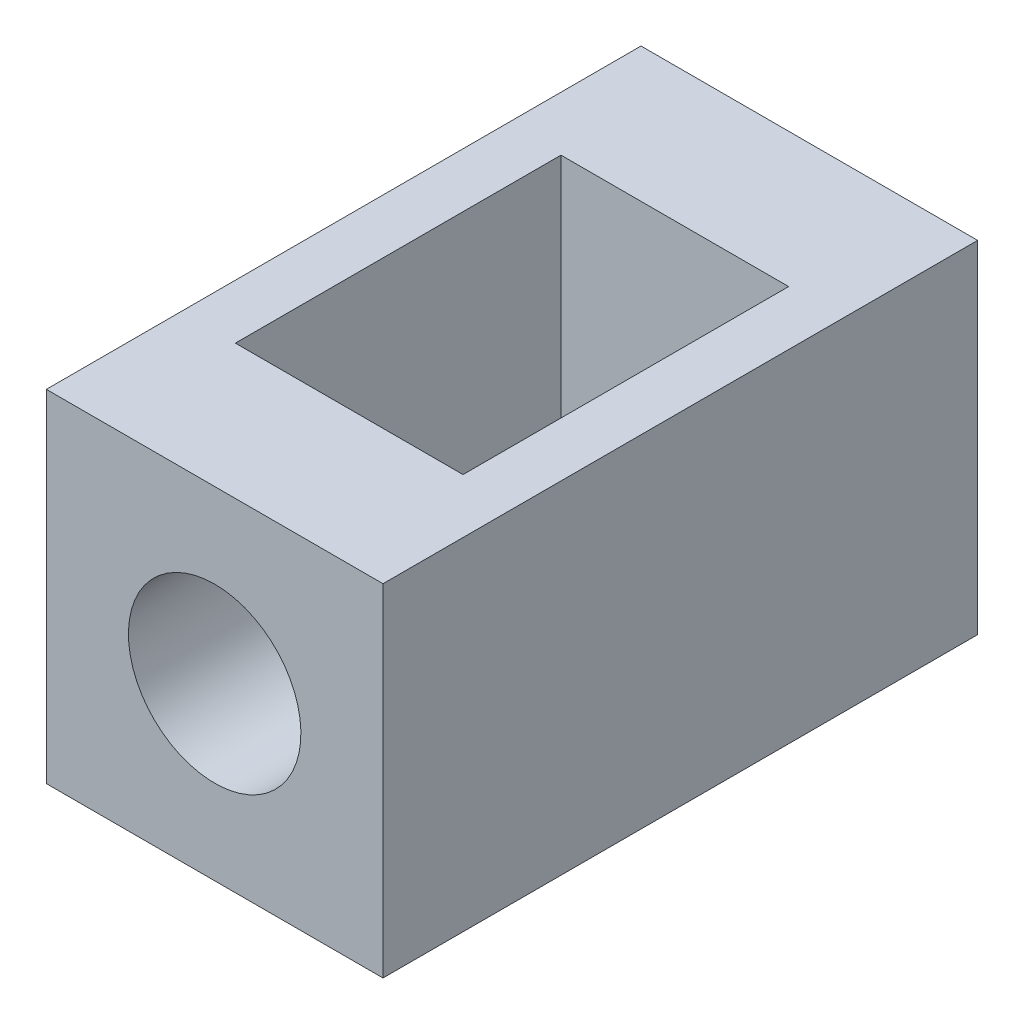
ISO-10303-21;
HEADER;
FILE_DESCRIPTION(('STEP AP214'),'2;1');
FILE_NAME('part.step','',(''),(''),'','','');
FILE_SCHEMA(('AUTOMOTIVE_DESIGN { 1 0 10303 214 1 1 1 1 }'));
ENDSEC;
DATA;
#1=APPLICATION_CONTEXT('core data for automotive mechanical design processes');
#2=APPLICATION_PROTOCOL_DEFINITION('international standard','automotive_design',2000,#1);
#3=PRODUCT_CONTEXT('',#1,'mechanical');
#4=PRODUCT('Part','Part','',(#3));
#5=PRODUCT_RELATED_PRODUCT_CATEGORY('part','',(#4));
#6=PRODUCT_DEFINITION_FORMATION('','',#4);
#7=PRODUCT_DEFINITION_CONTEXT('part definition',#1,'design');
#8=PRODUCT_DEFINITION('design','',#6,#7);
#9=PRODUCT_DEFINITION_SHAPE('','',#8);
#10=(LENGTH_UNIT() NAMED_UNIT(*) SI_UNIT(.MILLI.,.METRE.));
#11=(NAMED_UNIT(*) PLANE_ANGLE_UNIT() SI_UNIT($,.RADIAN.));
#12=(NAMED_UNIT(*) SI_UNIT($,.STERADIAN.) SOLID_ANGLE_UNIT());
#13=UNCERTAINTY_MEASURE_WITH_UNIT(LENGTH_MEASURE(1.E-05),#10,'distance_accuracy_value','');
#14=(GEOMETRIC_REPRESENTATION_CONTEXT(3) GLOBAL_UNCERTAINTY_ASSIGNED_CONTEXT((#13)) GLOBAL_UNIT_ASSIGNED_CONTEXT((#10,
#11,#12)) REPRESENTATION_CONTEXT('',''));
#15=CARTESIAN_POINT('',(0.,0.,0.));
#16=DIRECTION('',(0.,0.,1.));
#17=DIRECTION('',(1.,0.,0.));
#18=AXIS2_PLACEMENT_3D('',#15,#16,#17);
#19=CARTESIAN_POINT('',(0.0121980967922042,-23.3190363147215,14.4950000000003));
#20=DIRECTION('',(0.,0.,1.));
#21=DIRECTION('',(3.01991605000675E-07,0.999999999999954,0.));
#22=AXIS2_PLACEMENT_3D('',#19,#20,#21);
#23=CYLINDRICAL_SURFACE('',#22,1.25);
#24=CARTESIAN_POINT('',(0.0121980967922042,-23.3190363147207,12.5450000000003));
#25=DIRECTION('',(0.,0.,1.));
#26=DIRECTION('',(3.01991605000675E-07,0.999999999999954,0.));
#27=AXIS2_PLACEMENT_3D('',#24,#25,#26);
#28=CIRCLE('',#27,1.25);
#29=CARTESIAN_POINT('',(0.0121984742817104,-22.0690363147208,12.5450000000003));
#30=VERTEX_POINT('',#29);
#31=EDGE_CURVE('E20',#30,#30,#28,.T.);
#32=ORIENTED_EDGE('',*,*,#31,.F.);
#33=EDGE_LOOP('',(#32));
#34=FACE_BOUND('',#33,.T.);
#35=CARTESIAN_POINT('',(0.0121980967922042,-23.3190363147215,14.4950000000003));
#36=DIRECTION('',(0.,0.,1.));
#37=DIRECTION('',(3.01991605000675E-07,0.999999999999954,0.));
#38=AXIS2_PLACEMENT_3D('',#35,#36,#37);
#39=CIRCLE('',#38,1.25);
#40=CARTESIAN_POINT('',(0.0121984742817104,-22.0690363147216,14.4950000000003));
#41=VERTEX_POINT('',#40);
#42=EDGE_CURVE('E11',#41,#41,#39,.T.);
#43=ORIENTED_EDGE('',*,*,#42,.T.);
#44=EDGE_LOOP('',(#43));
#45=FACE_BOUND('',#44,.T.);
#46=ADVANCED_FACE('F17',(#34,#45),#23,.F.);
#47=CARTESIAN_POINT('',(2.4521973493632,-25.7940370515804,14.4950000000004));
#48=DIRECTION('',(-0.999999999999954,3.01991605000676E-07,0.));
#49=DIRECTION('',(3.01991605000675E-07,0.999999999999954,0.));
#50=AXIS2_PLACEMENT_3D('',#47,#48,#49);
#51=PLANE('',#50);
#52=DIRECTION('',(0.,0.,1.));
#53=VECTOR('',#52,1.);
#54=CARTESIAN_POINT('',(2.45219884422118,-20.8440370515805,14.4950000000003));
#55=LINE('',#54,#53);
#56=CARTESIAN_POINT('',(2.45219884422118,-20.8440370515808,5.87500000000036));
#57=VERTEX_POINT('',#56);
#58=CARTESIAN_POINT('',(2.45219884422118,-20.8440370515805,14.4950000000003));
#59=VERTEX_POINT('',#58);
#60=EDGE_CURVE('E171',#57,#59,#55,.T.);
#61=ORIENTED_EDGE('',*,*,#60,.T.);
#62=DIRECTION('',(3.01991605000675E-07,0.999999999999954,0.));
#63=VECTOR('',#62,1.);
#64=CARTESIAN_POINT('',(2.4521973493632,-25.7940370515804,14.4950000000004));
#65=LINE('',#64,#63);
#66=CARTESIAN_POINT('',(2.4521973493632,-25.7940370515804,14.4950000000004));
#67=VERTEX_POINT('',#66);
#68=EDGE_CURVE('E27',#67,#59,#65,.T.);
#69=ORIENTED_EDGE('',*,*,#68,.F.);
#70=DIRECTION('',(0.,0.,1.));
#71=VECTOR('',#70,1.);
#72=CARTESIAN_POINT('',(2.4521973493632,-25.7940370515804,14.4950000000004));
#73=LINE('',#72,#71);
#74=CARTESIAN_POINT('',(2.4521973493632,-25.7940370515803,5.87500000000033));
#75=VERTEX_POINT('',#74);
#76=EDGE_CURVE('E224',#75,#67,#73,.T.);
#77=ORIENTED_EDGE('',*,*,#76,.F.);
#78=DIRECTION('',(3.01991605000675E-07,0.999999999999954,0.));
#79=VECTOR('',#78,1.);
#80=CARTESIAN_POINT('',(2.4521973493632,-25.7940370515803,5.87500000000033));
#81=LINE('',#80,#79);
#82=EDGE_CURVE('E73',#75,#57,#81,.T.);
#83=ORIENTED_EDGE('',*,*,#82,.T.);
#84=EDGE_LOOP('',(#61,#69,#77,#83));
#85=FACE_BOUND('',#84,.T.);
#86=ADVANCED_FACE('F282',(#85),#51,.F.);
#87=CARTESIAN_POINT('',(-2.4278026506368,-25.7940355778613,14.4950000000003));
#88=DIRECTION('',(0.,0.,-1.));
#89=DIRECTION('',(0.999999999999954,-3.01991605000676E-07,0.));
#90=AXIS2_PLACEMENT_3D('',#87,#88,#89);
#91=PLANE('',#90);
#92=ORIENTED_EDGE('',*,*,#42,.F.);
#93=EDGE_LOOP('',(#92));
#94=FACE_BOUND('',#93,.T.);
#95=DIRECTION('',(-0.999999999999954,3.01991605000676E-07,0.));
#96=VECTOR('',#95,1.);
#97=CARTESIAN_POINT('',(-2.42780115577881,-20.8440355778615,14.4950000000003));
#98=LINE('',#97,#96);
#99=CARTESIAN_POINT('',(-2.42780115577881,-20.8440355778615,14.4950000000003));
#100=VERTEX_POINT('',#99);
#101=EDGE_CURVE('E208',#59,#100,#98,.T.);
#102=ORIENTED_EDGE('',*,*,#101,.T.);
#103=DIRECTION('',(3.01991605000675E-07,0.999999999999954,0.));
#104=VECTOR('',#103,1.);
#105=CARTESIAN_POINT('',(-2.4278026506368,-25.7940355778613,14.4950000000003));
#106=LINE('',#105,#104);
#107=CARTESIAN_POINT('',(-2.4278026506368,-25.7940355778613,14.4950000000003));
#108=VERTEX_POINT('',#107);
#109=EDGE_CURVE('E213',#108,#100,#106,.T.);
#110=ORIENTED_EDGE('',*,*,#109,.F.);
#111=DIRECTION('',(-0.999999999999954,3.01991605000676E-07,0.));
#112=VECTOR('',#111,1.);
#113=CARTESIAN_POINT('',(-2.4278026506368,-25.7940355778613,14.4950000000003));
#114=LINE('',#113,#112);
#115=EDGE_CURVE('E219',#67,#108,#114,.T.);
#116=ORIENTED_EDGE('',*,*,#115,.F.);
#117=ORIENTED_EDGE('',*,*,#68,.T.);
#118=EDGE_LOOP('',(#102,#110,#116,#117));
#119=FACE_BOUND('',#118,.T.);
#120=ADVANCED_FACE('F285',(#94,#119),#91,.F.);
#121=CARTESIAN_POINT('',(-2.4278026506368,-25.7940355778613,14.4950000000003));
#122=DIRECTION('',(0.999999999999954,-3.01991605000676E-07,0.));
#123=DIRECTION('',(-3.01991605000675E-07,-0.999999999999954,0.));
#124=AXIS2_PLACEMENT_3D('',#121,#122,#123);
#125=PLANE('',#124);
#126=DIRECTION('',(0.,0.,-1.));
#127=VECTOR('',#126,1.);
#128=CARTESIAN_POINT('',(-2.42780115577881,-20.8440355778615,14.4950000000003));
#129=LINE('',#128,#127);
#130=CARTESIAN_POINT('',(-2.42780115577881,-20.8440355778618,5.8750000000003));
#131=VERTEX_POINT('',#130);
#132=EDGE_CURVE('E196',#100,#131,#129,.T.);
#133=ORIENTED_EDGE('',*,*,#132,.T.);
#134=DIRECTION('',(3.01991605000675E-07,0.999999999999954,0.));
#135=VECTOR('',#134,1.);
#136=CARTESIAN_POINT('',(-2.4278026506368,-25.7940355778612,5.87500000000027));
#137=LINE('',#136,#135);
#138=CARTESIAN_POINT('',(-2.4278026506368,-25.7940355778612,5.87500000000027));
#139=VERTEX_POINT('',#138);
#140=EDGE_CURVE('E39',#139,#131,#137,.T.);
#141=ORIENTED_EDGE('',*,*,#140,.F.);
#142=DIRECTION('',(0.,0.,-1.));
#143=VECTOR('',#142,1.);
#144=CARTESIAN_POINT('',(-2.4278026506368,-25.7940355778613,14.4950000000003));
#145=LINE('',#144,#143);
#146=EDGE_CURVE('E203',#108,#139,#145,.T.);
#147=ORIENTED_EDGE('',*,*,#146,.F.);
#148=ORIENTED_EDGE('',*,*,#109,.T.);
#149=EDGE_LOOP('',(#133,#141,#147,#148));
#150=FACE_BOUND('',#149,.T.);
#151=ADVANCED_FACE('F287',(#150),#125,.F.);
#152=CARTESIAN_POINT('',(-2.4278026506368,-25.7940355778612,5.87500000000027));
#153=DIRECTION('',(0.,0.,1.));
#154=DIRECTION('',(-0.999999999999954,3.01991605000676E-07,0.));
#155=AXIS2_PLACEMENT_3D('',#152,#153,#154);
#156=PLANE('',#155);
#157=DIRECTION('',(0.999999999999954,-3.01991605000676E-07,0.));
#158=VECTOR('',#157,1.);
#159=CARTESIAN_POINT('',(-2.42780115577881,-20.8440355778618,5.8750000000003));
#160=LINE('',#159,#158);
#161=EDGE_CURVE('E193',#131,#57,#160,.T.);
#162=ORIENTED_EDGE('',*,*,#161,.T.);
#163=ORIENTED_EDGE('',*,*,#82,.F.);
#164=DIRECTION('',(0.999999999999954,-3.01991605000676E-07,0.));
#165=VECTOR('',#164,1.);
#166=CARTESIAN_POINT('',(-2.4278026506368,-25.7940355778612,5.87500000000027));
#167=LINE('',#166,#165);
#168=EDGE_CURVE('E199',#139,#75,#167,.T.);
#169=ORIENTED_EDGE('',*,*,#168,.F.);
#170=ORIENTED_EDGE('',*,*,#140,.T.);
#171=EDGE_LOOP('',(#162,#163,#169,#170));
#172=FACE_BOUND('',#171,.T.);
#173=ADVANCED_FACE('F303',(#172),#156,.F.);
#174=CARTESIAN_POINT('',(0.0121973493631966,-25.7940363147208,10.1850000000003));
#175=DIRECTION('',(-3.01991605000675E-07,-0.999999999999954,0.));
#176=DIRECTION('',(-0.999999999999954,3.01991605000676E-07,0.));
#177=AXIS2_PLACEMENT_3D('',#174,#175,#176);
#178=PLANE('',#177);
#179=DIRECTION('',(0.,0.,1.));
#180=VECTOR('',#179,1.);
#181=CARTESIAN_POINT('',(1.66219734936318,-25.794036813007,10.1850000000003));
#182=LINE('',#181,#180);
#183=CARTESIAN_POINT('',(1.66219734936318,-25.794036813007,7.82500000000032));
#184=VERTEX_POINT('',#183);
#185=CARTESIAN_POINT('',(1.66219734936318,-25.794036813007,12.5450000000003));
#186=VERTEX_POINT('',#185);
#187=EDGE_CURVE('E166',#184,#186,#182,.T.);
#188=ORIENTED_EDGE('',*,*,#187,.F.);
#189=DIRECTION('',(0.999999999999954,-3.01991605000676E-07,0.));
#190=VECTOR('',#189,1.);
#191=CARTESIAN_POINT('',(0.0121973493631966,-25.7940363147208,7.8250000000003));
#192=LINE('',#191,#190);
#193=CARTESIAN_POINT('',(-1.63780265063682,-25.7940358164346,7.82500000000028));
#194=VERTEX_POINT('',#193);
#195=EDGE_CURVE('E127',#194,#184,#192,.T.);
#196=ORIENTED_EDGE('',*,*,#195,.F.);
#197=DIRECTION('',(0.,0.,-1.));
#198=VECTOR('',#197,1.);
#199=CARTESIAN_POINT('',(-1.63780265063682,-25.7940358164347,10.1850000000003));
#200=LINE('',#199,#198);
#201=CARTESIAN_POINT('',(-1.63780265063682,-25.7940358164347,12.5450000000003));
#202=VERTEX_POINT('',#201);
#203=EDGE_CURVE('E151',#202,#194,#200,.T.);
#204=ORIENTED_EDGE('',*,*,#203,.F.);
#205=DIRECTION('',(-0.999999999999954,3.01991605000676E-07,0.));
#206=VECTOR('',#205,1.);
#207=CARTESIAN_POINT('',(0.0121973493631966,-25.7940363147208,12.5450000000003));
#208=LINE('',#207,#206);
#209=EDGE_CURVE('E140',#186,#202,#208,.T.);
#210=ORIENTED_EDGE('',*,*,#209,.F.);
#211=EDGE_LOOP('',(#188,#196,#204,#210));
#212=FACE_BOUND('',#211,.T.);
#213=ORIENTED_EDGE('',*,*,#76,.T.);
#214=ORIENTED_EDGE('',*,*,#115,.T.);
#215=ORIENTED_EDGE('',*,*,#146,.T.);
#216=ORIENTED_EDGE('',*,*,#168,.T.);
#217=EDGE_LOOP('',(#213,#214,#215,#216));
#218=FACE_BOUND('',#217,.T.);
#219=ADVANCED_FACE('F293',(#212,#218),#178,.T.);
#220=CARTESIAN_POINT('',(0.012198844221184,-20.8440363147207,10.1850000000003));
#221=DIRECTION('',(-3.01991605000675E-07,-0.999999999999954,0.));
#222=DIRECTION('',(-0.999999999999954,3.01991605000676E-07,0.));
#223=AXIS2_PLACEMENT_3D('',#220,#221,#222);
#224=PLANE('',#223);
#225=DIRECTION('',(0.999999999999954,-3.01991605000676E-07,0.));
#226=VECTOR('',#225,1.);
#227=CARTESIAN_POINT('',(-1.6378011557788,-20.8440358164346,7.82500000000031));
#228=LINE('',#227,#226);
#229=CARTESIAN_POINT('',(-1.6378011557788,-20.8440358164346,7.82500000000031));
#230=VERTEX_POINT('',#229);
#231=CARTESIAN_POINT('',(1.6621988442212,-20.8440368130075,7.82500000000035));
#232=VERTEX_POINT('',#231);
#233=EDGE_CURVE('E161',#230,#232,#228,.T.);
#234=ORIENTED_EDGE('',*,*,#233,.T.);
#235=DIRECTION('',(0.,0.,1.));
#236=VECTOR('',#235,1.);
#237=CARTESIAN_POINT('',(1.6621988442212,-20.8440368130078,12.5450000000003));
#238=LINE('',#237,#236);
#239=CARTESIAN_POINT('',(1.6621988442212,-20.8440368130078,12.5450000000003));
#240=VERTEX_POINT('',#239);
#241=EDGE_CURVE('E84',#232,#240,#238,.T.);
#242=ORIENTED_EDGE('',*,*,#241,.T.);
#243=DIRECTION('',(-0.999999999999954,3.01991605000676E-07,0.));
#244=VECTOR('',#243,1.);
#245=CARTESIAN_POINT('',(-1.6378011557788,-20.8440358164347,12.5450000000003));
#246=LINE('',#245,#244);
#247=CARTESIAN_POINT('',(-1.6378011557788,-20.8440358164347,12.5450000000003));
#248=VERTEX_POINT('',#247);
#249=EDGE_CURVE('E130',#240,#248,#246,.T.);
#250=ORIENTED_EDGE('',*,*,#249,.T.);
#251=DIRECTION('',(0.,0.,-1.));
#252=VECTOR('',#251,1.);
#253=CARTESIAN_POINT('',(-1.6378011557788,-20.8440358164347,12.5450000000003));
#254=LINE('',#253,#252);
#255=EDGE_CURVE('E116',#248,#230,#254,.T.);
#256=ORIENTED_EDGE('',*,*,#255,.T.);
#257=EDGE_LOOP('',(#234,#242,#250,#256));
#258=FACE_BOUND('',#257,.T.);
#259=ORIENTED_EDGE('',*,*,#60,.F.);
#260=ORIENTED_EDGE('',*,*,#161,.F.);
#261=ORIENTED_EDGE('',*,*,#132,.F.);
#262=ORIENTED_EDGE('',*,*,#101,.F.);
#263=EDGE_LOOP('',(#259,#260,#261,#262));
#264=FACE_BOUND('',#263,.T.);
#265=ADVANCED_FACE('F131',(#258,#264),#224,.F.);
#266=CARTESIAN_POINT('',(1.6621988442212,-20.8440368130078,12.5450000000003));
#267=DIRECTION('',(0.999999999999954,-3.01991605000676E-07,0.));
#268=DIRECTION('',(-3.01991605000675E-07,-0.999999999999954,0.));
#269=AXIS2_PLACEMENT_3D('',#266,#267,#268);
#270=PLANE('',#269);
#271=ORIENTED_EDGE('',*,*,#187,.T.);
#272=DIRECTION('',(-3.01991605000675E-07,-0.999999999999954,0.));
#273=VECTOR('',#272,1.);
#274=CARTESIAN_POINT('',(1.6621988442212,-20.8440368130078,12.5450000000003));
#275=LINE('',#274,#273);
#276=EDGE_CURVE('E136',#240,#186,#275,.T.);
#277=ORIENTED_EDGE('',*,*,#276,.F.);
#278=ORIENTED_EDGE('',*,*,#241,.F.);
#279=DIRECTION('',(-3.01991605000675E-07,-0.999999999999954,0.));
#280=VECTOR('',#279,1.);
#281=CARTESIAN_POINT('',(1.6621988442212,-20.8440368130075,7.82500000000035));
#282=LINE('',#281,#280);
#283=EDGE_CURVE('E158',#232,#184,#282,.T.);
#284=ORIENTED_EDGE('',*,*,#283,.T.);
#285=EDGE_LOOP('',(#271,#277,#278,#284));
#286=FACE_BOUND('',#285,.T.);
#287=ADVANCED_FACE('F312',(#286),#270,.F.);
#288=CARTESIAN_POINT('',(-1.6378011557788,-20.8440358164346,7.82500000000031));
#289=DIRECTION('',(0.,0.,-1.));
#290=DIRECTION('',(-3.01991605000675E-07,-0.999999999999954,0.));
#291=AXIS2_PLACEMENT_3D('',#288,#289,#290);
#292=PLANE('',#291);
#293=ORIENTED_EDGE('',*,*,#195,.T.);
#294=ORIENTED_EDGE('',*,*,#283,.F.);
#295=ORIENTED_EDGE('',*,*,#233,.F.);
#296=DIRECTION('',(-3.01991605000675E-07,-0.999999999999954,0.));
#297=VECTOR('',#296,1.);
#298=CARTESIAN_POINT('',(-1.6378011557788,-20.8440358164346,7.82500000000031));
#299=LINE('',#298,#297);
#300=EDGE_CURVE('E124',#230,#194,#299,.T.);
#301=ORIENTED_EDGE('',*,*,#300,.T.);
#302=EDGE_LOOP('',(#293,#294,#295,#301));
#303=FACE_BOUND('',#302,.T.);
#304=ADVANCED_FACE('F315',(#303),#292,.F.);
#305=CARTESIAN_POINT('',(-1.6378011557788,-20.8440358164347,12.5450000000003));
#306=DIRECTION('',(-0.999999999999954,3.01991605000676E-07,0.));
#307=DIRECTION('',(3.01991605000675E-07,0.999999999999954,0.));
#308=AXIS2_PLACEMENT_3D('',#305,#306,#307);
#309=PLANE('',#308);
#310=ORIENTED_EDGE('',*,*,#203,.T.);
#311=ORIENTED_EDGE('',*,*,#300,.F.);
#312=ORIENTED_EDGE('',*,*,#255,.F.);
#313=DIRECTION('',(-3.01991605000675E-07,-0.999999999999954,0.));
#314=VECTOR('',#313,1.);
#315=CARTESIAN_POINT('',(-1.6378011557788,-20.8440358164347,12.5450000000003));
#316=LINE('',#315,#314);
#317=EDGE_CURVE('E121',#248,#202,#316,.T.);
#318=ORIENTED_EDGE('',*,*,#317,.T.);
#319=EDGE_LOOP('',(#310,#311,#312,#318));
#320=FACE_BOUND('',#319,.T.);
#321=ADVANCED_FACE('F119',(#320),#309,.F.);
#322=CARTESIAN_POINT('',(-1.6378011557788,-20.8440358164347,12.5450000000003));
#323=DIRECTION('',(0.,0.,1.));
#324=DIRECTION('',(3.01991605000675E-07,0.999999999999954,0.));
#325=AXIS2_PLACEMENT_3D('',#322,#323,#324);
#326=PLANE('',#325);
#327=ORIENTED_EDGE('',*,*,#31,.T.);
#328=EDGE_LOOP('',(#327));
#329=FACE_BOUND('',#328,.T.);
#330=ORIENTED_EDGE('',*,*,#209,.T.);
#331=ORIENTED_EDGE('',*,*,#317,.F.);
#332=ORIENTED_EDGE('',*,*,#249,.F.);
#333=ORIENTED_EDGE('',*,*,#276,.T.);
#334=EDGE_LOOP('',(#330,#331,#332,#333));
#335=FACE_BOUND('',#334,.T.);
#336=ADVANCED_FACE('F138',(#329,#335),#326,.F.);
#337=CLOSED_SHELL('',(#46,#86,#120,#151,#173,#219,#265,#287,#304,#321,#336));
#338=MANIFOLD_SOLID_BREP('B1',#337);
#339=ADVANCED_BREP_SHAPE_REPRESENTATION('',(#18,#338),#14);
#340=SHAPE_DEFINITION_REPRESENTATION(#9,#339);
ENDSEC;
END-ISO-10303-21;
